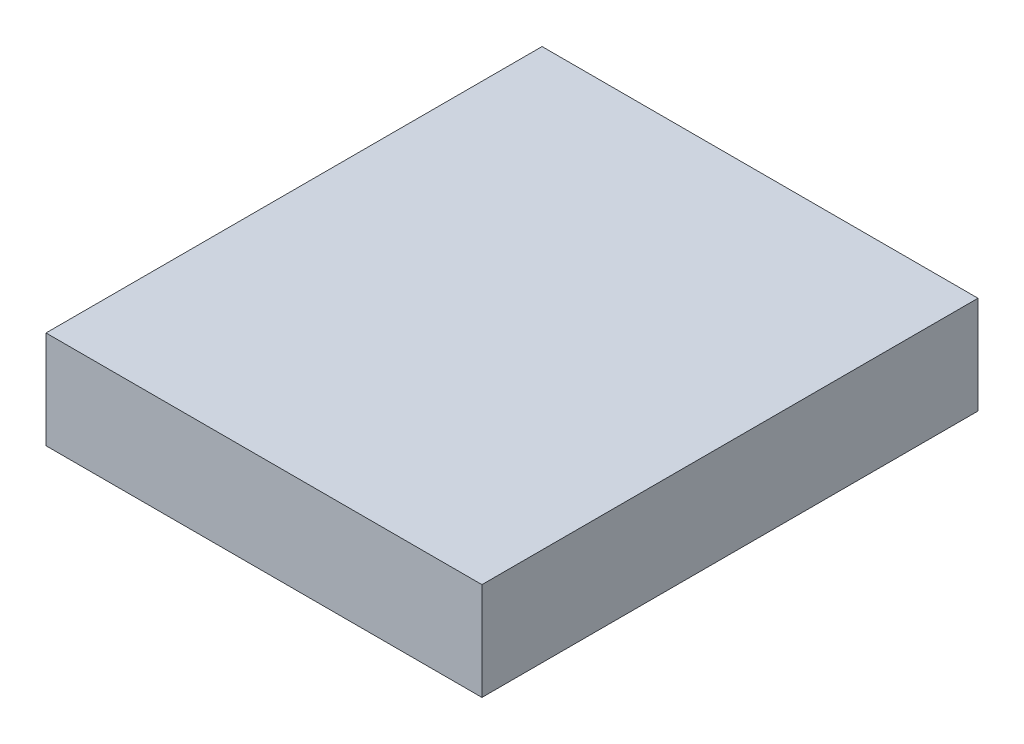
ISO-10303-21;
HEADER;
FILE_DESCRIPTION(('STEP AP214'),'2;1');
FILE_NAME('part.step','',(''),(''),'','','');
FILE_SCHEMA(('AUTOMOTIVE_DESIGN { 1 0 10303 214 1 1 1 1 }'));
ENDSEC;
DATA;
#1=APPLICATION_CONTEXT('core data for automotive mechanical design processes');
#2=APPLICATION_PROTOCOL_DEFINITION('international standard','automotive_design',2000,#1);
#3=PRODUCT_CONTEXT('',#1,'mechanical');
#4=PRODUCT('Part','Part','',(#3));
#5=PRODUCT_RELATED_PRODUCT_CATEGORY('part','',(#4));
#6=PRODUCT_DEFINITION_FORMATION('','',#4);
#7=PRODUCT_DEFINITION_CONTEXT('part definition',#1,'design');
#8=PRODUCT_DEFINITION('design','',#6,#7);
#9=PRODUCT_DEFINITION_SHAPE('','',#8);
#10=(LENGTH_UNIT() NAMED_UNIT(*) SI_UNIT(.MILLI.,.METRE.));
#11=(NAMED_UNIT(*) PLANE_ANGLE_UNIT() SI_UNIT($,.RADIAN.));
#12=(NAMED_UNIT(*) SI_UNIT($,.STERADIAN.) SOLID_ANGLE_UNIT());
#13=UNCERTAINTY_MEASURE_WITH_UNIT(LENGTH_MEASURE(1.E-05),#10,'distance_accuracy_value','');
#14=(GEOMETRIC_REPRESENTATION_CONTEXT(3) GLOBAL_UNCERTAINTY_ASSIGNED_CONTEXT((#13)) GLOBAL_UNIT_ASSIGNED_CONTEXT((#10,
#11,#12)) REPRESENTATION_CONTEXT('',''));
#15=CARTESIAN_POINT('',(0.,0.,0.));
#16=DIRECTION('',(0.,0.,1.));
#17=DIRECTION('',(1.,0.,0.));
#18=AXIS2_PLACEMENT_3D('',#15,#16,#17);
#19=CARTESIAN_POINT('',(0.,165.1,0.));
#20=DIRECTION('',(1.,0.,0.));
#21=DIRECTION('',(0.,0.,-1.));
#22=AXIS2_PLACEMENT_3D('',#19,#20,#21);
#23=PLANE('',#22);
#24=DIRECTION('',(0.,0.,1.));
#25=VECTOR('',#24,1.);
#26=CARTESIAN_POINT('',(0.,0.,0.));
#27=LINE('',#26,#25);
#28=CARTESIAN_POINT('',(0.,0.,-838.2));
#29=VERTEX_POINT('',#28);
#30=CARTESIAN_POINT('',(0.,0.,0.));
#31=VERTEX_POINT('',#30);
#32=EDGE_CURVE('E102',#29,#31,#27,.T.);
#33=ORIENTED_EDGE('',*,*,#32,.T.);
#34=DIRECTION('',(0.,-1.,0.));
#35=VECTOR('',#34,1.);
#36=CARTESIAN_POINT('',(0.,165.1,0.));
#37=LINE('',#36,#35);
#38=CARTESIAN_POINT('',(0.,165.1,0.));
#39=VERTEX_POINT('',#38);
#40=EDGE_CURVE('E11',#39,#31,#37,.T.);
#41=ORIENTED_EDGE('',*,*,#40,.F.);
#42=DIRECTION('',(0.,0.,1.));
#43=VECTOR('',#42,1.);
#44=CARTESIAN_POINT('',(0.,165.1,0.));
#45=LINE('',#44,#43);
#46=CARTESIAN_POINT('',(0.,165.1,-838.2));
#47=VERTEX_POINT('',#46);
#48=EDGE_CURVE('E90',#47,#39,#45,.T.);
#49=ORIENTED_EDGE('',*,*,#48,.F.);
#50=DIRECTION('',(0.,-1.,0.));
#51=VECTOR('',#50,1.);
#52=CARTESIAN_POINT('',(0.,165.1,-838.2));
#53=LINE('',#52,#51);
#54=EDGE_CURVE('E98',#47,#29,#53,.T.);
#55=ORIENTED_EDGE('',*,*,#54,.T.);
#56=EDGE_LOOP('',(#33,#41,#49,#55));
#57=FACE_BOUND('',#56,.T.);
#58=ADVANCED_FACE('F39',(#57),#23,.F.);
#59=CARTESIAN_POINT('',(0.,165.1,0.));
#60=DIRECTION('',(0.,0.,-1.));
#61=DIRECTION('',(-1.,0.,0.));
#62=AXIS2_PLACEMENT_3D('',#59,#60,#61);
#63=PLANE('',#62);
#64=DIRECTION('',(1.,0.,0.));
#65=VECTOR('',#64,1.);
#66=CARTESIAN_POINT('',(0.,0.,0.));
#67=LINE('',#66,#65);
#68=CARTESIAN_POINT('',(736.6,0.,0.));
#69=VERTEX_POINT('',#68);
#70=EDGE_CURVE('E94',#31,#69,#67,.T.);
#71=ORIENTED_EDGE('',*,*,#70,.T.);
#72=DIRECTION('',(0.,-1.,0.));
#73=VECTOR('',#72,1.);
#74=CARTESIAN_POINT('',(736.6,165.1,0.));
#75=LINE('',#74,#73);
#76=CARTESIAN_POINT('',(736.6,165.1,0.));
#77=VERTEX_POINT('',#76);
#78=EDGE_CURVE('E47',#77,#69,#75,.T.);
#79=ORIENTED_EDGE('',*,*,#78,.F.);
#80=DIRECTION('',(1.,0.,0.));
#81=VECTOR('',#80,1.);
#82=CARTESIAN_POINT('',(0.,165.1,0.));
#83=LINE('',#82,#81);
#84=EDGE_CURVE('E85',#39,#77,#83,.T.);
#85=ORIENTED_EDGE('',*,*,#84,.F.);
#86=ORIENTED_EDGE('',*,*,#40,.T.);
#87=EDGE_LOOP('',(#71,#79,#85,#86));
#88=FACE_BOUND('',#87,.T.);
#89=ADVANCED_FACE('F93',(#88),#63,.F.);
#90=CARTESIAN_POINT('',(736.6,165.1,0.));
#91=DIRECTION('',(-1.,0.,0.));
#92=DIRECTION('',(0.,0.,1.));
#93=AXIS2_PLACEMENT_3D('',#90,#91,#92);
#94=PLANE('',#93);
#95=DIRECTION('',(0.,0.,-1.));
#96=VECTOR('',#95,1.);
#97=CARTESIAN_POINT('',(736.6,0.,0.));
#98=LINE('',#97,#96);
#99=CARTESIAN_POINT('',(736.6,0.,-838.2));
#100=VERTEX_POINT('',#99);
#101=EDGE_CURVE('E72',#69,#100,#98,.T.);
#102=ORIENTED_EDGE('',*,*,#101,.T.);
#103=DIRECTION('',(0.,-1.,0.));
#104=VECTOR('',#103,1.);
#105=CARTESIAN_POINT('',(736.6,165.1,-838.2));
#106=LINE('',#105,#104);
#107=CARTESIAN_POINT('',(736.6,165.1,-838.2));
#108=VERTEX_POINT('',#107);
#109=EDGE_CURVE('E95',#108,#100,#106,.T.);
#110=ORIENTED_EDGE('',*,*,#109,.F.);
#111=DIRECTION('',(0.,0.,-1.));
#112=VECTOR('',#111,1.);
#113=CARTESIAN_POINT('',(736.6,165.1,0.));
#114=LINE('',#113,#112);
#115=EDGE_CURVE('E88',#77,#108,#114,.T.);
#116=ORIENTED_EDGE('',*,*,#115,.F.);
#117=ORIENTED_EDGE('',*,*,#78,.T.);
#118=EDGE_LOOP('',(#102,#110,#116,#117));
#119=FACE_BOUND('',#118,.T.);
#120=ADVANCED_FACE('F96',(#119),#94,.F.);
#121=CARTESIAN_POINT('',(0.,165.1,-838.2));
#122=DIRECTION('',(0.,0.,1.));
#123=DIRECTION('',(1.,0.,0.));
#124=AXIS2_PLACEMENT_3D('',#121,#122,#123);
#125=PLANE('',#124);
#126=DIRECTION('',(-1.,0.,0.));
#127=VECTOR('',#126,1.);
#128=CARTESIAN_POINT('',(0.,0.,-838.2));
#129=LINE('',#128,#127);
#130=EDGE_CURVE('E78',#100,#29,#129,.T.);
#131=ORIENTED_EDGE('',*,*,#130,.T.);
#132=ORIENTED_EDGE('',*,*,#54,.F.);
#133=DIRECTION('',(-1.,0.,0.));
#134=VECTOR('',#133,1.);
#135=CARTESIAN_POINT('',(0.,165.1,-838.2));
#136=LINE('',#135,#134);
#137=EDGE_CURVE('E55',#108,#47,#136,.T.);
#138=ORIENTED_EDGE('',*,*,#137,.F.);
#139=ORIENTED_EDGE('',*,*,#109,.T.);
#140=EDGE_LOOP('',(#131,#132,#138,#139));
#141=FACE_BOUND('',#140,.T.);
#142=ADVANCED_FACE('F109',(#141),#125,.F.);
#143=CARTESIAN_POINT('',(0.,165.1,0.));
#144=DIRECTION('',(0.,-1.,0.));
#145=DIRECTION('',(0.,0.,-1.));
#146=AXIS2_PLACEMENT_3D('',#143,#144,#145);
#147=PLANE('',#146);
#148=ORIENTED_EDGE('',*,*,#48,.T.);
#149=ORIENTED_EDGE('',*,*,#84,.T.);
#150=ORIENTED_EDGE('',*,*,#115,.T.);
#151=ORIENTED_EDGE('',*,*,#137,.T.);
#152=EDGE_LOOP('',(#148,#149,#150,#151));
#153=FACE_BOUND('',#152,.T.);
#154=ADVANCED_FACE('F86',(#153),#147,.F.);
#155=CARTESIAN_POINT('',(0.,0.,0.));
#156=DIRECTION('',(0.,-1.,0.));
#157=DIRECTION('',(0.,0.,-1.));
#158=AXIS2_PLACEMENT_3D('',#155,#156,#157);
#159=PLANE('',#158);
#160=ORIENTED_EDGE('',*,*,#32,.F.);
#161=ORIENTED_EDGE('',*,*,#130,.F.);
#162=ORIENTED_EDGE('',*,*,#101,.F.);
#163=ORIENTED_EDGE('',*,*,#70,.F.);
#164=EDGE_LOOP('',(#160,#161,#162,#163));
#165=FACE_BOUND('',#164,.T.);
#166=ADVANCED_FACE('F112',(#165),#159,.T.);
#167=CLOSED_SHELL('',(#58,#89,#120,#142,#154,#166));
#168=MANIFOLD_SOLID_BREP('B2',#167);
#169=ADVANCED_BREP_SHAPE_REPRESENTATION('',(#18,#168),#14);
#170=SHAPE_DEFINITION_REPRESENTATION(#9,#169);
ENDSEC;
END-ISO-10303-21;
